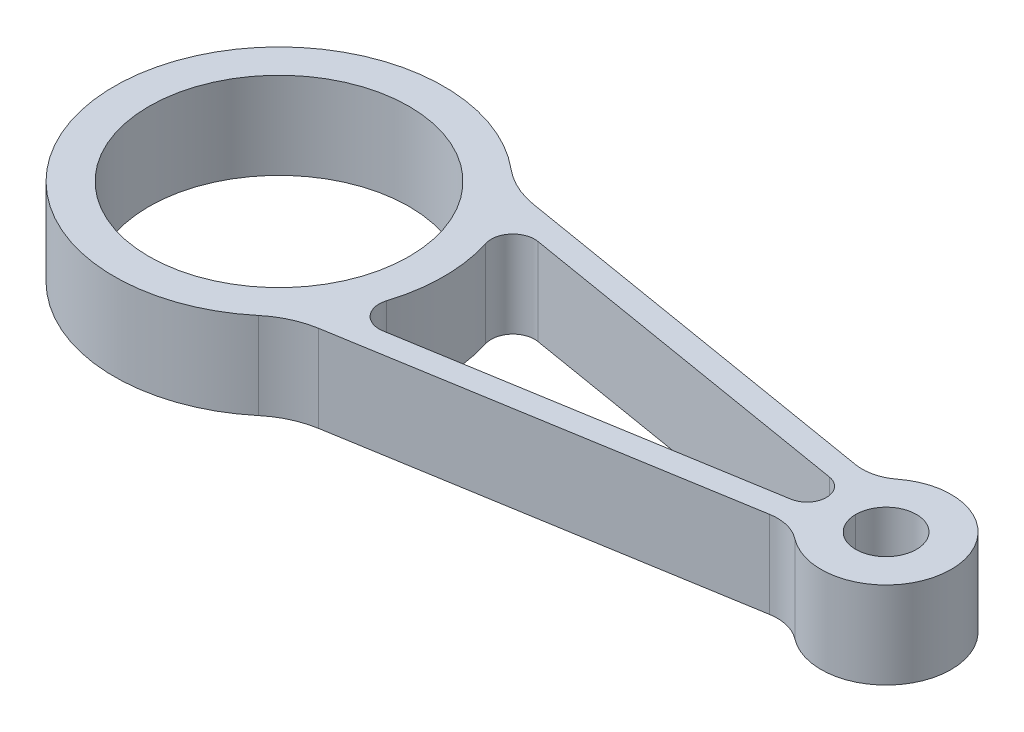
ISO-10303-21;
HEADER;
FILE_DESCRIPTION(('STEP AP214'),'2;1');
FILE_NAME('part.step','',(''),(''),'','','');
FILE_SCHEMA(('AUTOMOTIVE_DESIGN { 1 0 10303 214 1 1 1 1 }'));
ENDSEC;
DATA;
#1=APPLICATION_CONTEXT('core data for automotive mechanical design processes');
#2=APPLICATION_PROTOCOL_DEFINITION('international standard','automotive_design',2000,#1);
#3=PRODUCT_CONTEXT('',#1,'mechanical');
#4=PRODUCT('Part','Part','',(#3));
#5=PRODUCT_RELATED_PRODUCT_CATEGORY('part','',(#4));
#6=PRODUCT_DEFINITION_FORMATION('','',#4);
#7=PRODUCT_DEFINITION_CONTEXT('part definition',#1,'design');
#8=PRODUCT_DEFINITION('design','',#6,#7);
#9=PRODUCT_DEFINITION_SHAPE('','',#8);
#10=(LENGTH_UNIT() NAMED_UNIT(*) SI_UNIT(.MILLI.,.METRE.));
#11=(NAMED_UNIT(*) PLANE_ANGLE_UNIT() SI_UNIT($,.RADIAN.));
#12=(NAMED_UNIT(*) SI_UNIT($,.STERADIAN.) SOLID_ANGLE_UNIT());
#13=UNCERTAINTY_MEASURE_WITH_UNIT(LENGTH_MEASURE(1.E-05),#10,'distance_accuracy_value','');
#14=(GEOMETRIC_REPRESENTATION_CONTEXT(3) GLOBAL_UNCERTAINTY_ASSIGNED_CONTEXT((#13)) GLOBAL_UNIT_ASSIGNED_CONTEXT((#10,
#11,#12)) REPRESENTATION_CONTEXT('',''));
#15=CARTESIAN_POINT('',(0.,0.,0.));
#16=DIRECTION('',(0.,0.,1.));
#17=DIRECTION('',(1.,0.,0.));
#18=AXIS2_PLACEMENT_3D('',#15,#16,#17);
#19=CARTESIAN_POINT('',(140.,10.,0.));
#20=DIRECTION('',(0.,-1.,0.));
#21=DIRECTION('',(0.,0.,-1.));
#22=AXIS2_PLACEMENT_3D('',#19,#20,#21);
#23=CYLINDRICAL_SURFACE('',#22,7.00000000000001);
#24=CARTESIAN_POINT('',(140.,10.,0.));
#25=DIRECTION('',(0.,1.,0.));
#26=DIRECTION('',(0.,0.,1.));
#27=AXIS2_PLACEMENT_3D('',#24,#25,#26);
#28=CIRCLE('',#27,7.00000000000001);
#29=CARTESIAN_POINT('',(147.,10.,0.));
#30=VERTEX_POINT('',#29);
#31=CARTESIAN_POINT('',(133.,10.,0.));
#32=VERTEX_POINT('',#31);
#33=EDGE_CURVE('E210',#30,#32,#28,.T.);
#34=ORIENTED_EDGE('',*,*,#33,.T.);
#35=DIRECTION('',(0.,-1.,0.));
#36=VECTOR('',#35,1.);
#37=CARTESIAN_POINT('',(133.,10.,0.));
#38=LINE('',#37,#36);
#39=CARTESIAN_POINT('',(133.,-10.,0.));
#40=VERTEX_POINT('',#39);
#41=EDGE_CURVE('E11',#32,#40,#38,.T.);
#42=ORIENTED_EDGE('',*,*,#41,.T.);
#43=CARTESIAN_POINT('',(140.,-10.,0.));
#44=DIRECTION('',(0.,1.,0.));
#45=DIRECTION('',(0.,0.,1.));
#46=AXIS2_PLACEMENT_3D('',#43,#44,#45);
#47=CIRCLE('',#46,7.00000000000001);
#48=CARTESIAN_POINT('',(147.,-10.,0.));
#49=VERTEX_POINT('',#48);
#50=EDGE_CURVE('E214',#49,#40,#47,.T.);
#51=ORIENTED_EDGE('',*,*,#50,.F.);
#52=DIRECTION('',(0.,1.,0.));
#53=VECTOR('',#52,1.);
#54=CARTESIAN_POINT('',(147.,10.,0.));
#55=LINE('',#54,#53);
#56=EDGE_CURVE('E49',#49,#30,#55,.T.);
#57=ORIENTED_EDGE('',*,*,#56,.T.);
#58=EDGE_LOOP('',(#34,#42,#51,#57));
#59=FACE_BOUND('',#58,.T.);
#60=ADVANCED_FACE('F40',(#59),#23,.F.);
#61=CARTESIAN_POINT('',(0.,10.,0.));
#62=DIRECTION('',(0.,1.,0.));
#63=DIRECTION('',(0.,0.,1.));
#64=AXIS2_PLACEMENT_3D('',#61,#62,#63);
#65=PLANE('',#64);
#66=ORIENTED_EDGE('',*,*,#33,.F.);
#67=EDGE_CURVE('E213',#32,#30,#28,.T.);
#68=ORIENTED_EDGE('',*,*,#67,.F.);
#69=EDGE_LOOP('',(#66,#68));
#70=FACE_BOUND('',#69,.T.);
#71=CARTESIAN_POINT('',(140.,10.,0.));
#72=DIRECTION('',(0.,1.,0.));
#73=DIRECTION('',(0.,0.,1.));
#74=AXIS2_PLACEMENT_3D('',#71,#72,#73);
#75=CIRCLE('',#74,15.);
#76=CARTESIAN_POINT('',(130.826967155943,10.,11.8682546501942));
#77=VERTEX_POINT('',#76);
#78=CARTESIAN_POINT('',(130.826967155943,10.,-11.8682546501942));
#79=VERTEX_POINT('',#78);
#80=EDGE_CURVE('E230',#77,#79,#75,.T.);
#81=ORIENTED_EDGE('',*,*,#80,.T.);
#82=CARTESIAN_POINT('',(124.711611926572,10.,-19.7804244169904));
#83=DIRECTION('',(0.,1.,0.));
#84=DIRECTION('',(0.,0.,1.));
#85=AXIS2_PLACEMENT_3D('',#82,#83,#84);
#86=CIRCLE('',#85,10.);
#87=CARTESIAN_POINT('',(123.068754783715,10.,-9.91629645714704));
#88=VERTEX_POINT('',#87);
#89=EDGE_CURVE('E280',#79,#88,#86,.F.);
#90=ORIENTED_EDGE('',*,*,#89,.T.);
#91=DIRECTION('',(-0.986412795984335,0.,-0.164285714285714));
#92=VECTOR('',#91,1.);
#93=CARTESIAN_POINT('',(27.9354736759494,10.,-25.7606154914888));
#94=LINE('',#93,#92);
#95=CARTESIAN_POINT('',(33.9230677395358,10.,-24.7633898151861));
#96=VERTEX_POINT('',#95);
#97=EDGE_CURVE('E233',#88,#96,#94,.T.);
#98=ORIENTED_EDGE('',*,*,#97,.T.);
#99=CARTESIAN_POINT('',(37.2087820252501,10.,-44.4916457348728));
#100=DIRECTION('',(0.,1.,0.));
#101=DIRECTION('',(0.,0.,1.));
#102=AXIS2_PLACEMENT_3D('',#99,#100,#101);
#103=CIRCLE('',#102,20.);
#104=CARTESIAN_POINT('',(24.3781675337846,10.,-29.1496989297442));
#105=VERTEX_POINT('',#104);
#106=EDGE_CURVE('E258',#96,#105,#103,.F.);
#107=ORIENTED_EDGE('',*,*,#106,.T.);
#108=CARTESIAN_POINT('',(0.,10.,0.));
#109=DIRECTION('',(0.,1.,0.));
#110=DIRECTION('',(0.,0.,1.));
#111=AXIS2_PLACEMENT_3D('',#108,#109,#110);
#112=CIRCLE('',#111,38.);
#113=CARTESIAN_POINT('',(24.3781675337846,10.,29.1496989297442));
#114=VERTEX_POINT('',#113);
#115=EDGE_CURVE('E223',#105,#114,#112,.T.);
#116=ORIENTED_EDGE('',*,*,#115,.T.);
#117=CARTESIAN_POINT('',(37.2087820252501,10.,44.4916457348728));
#118=DIRECTION('',(0.,1.,0.));
#119=DIRECTION('',(0.,0.,1.));
#120=AXIS2_PLACEMENT_3D('',#117,#118,#119);
#121=CIRCLE('',#120,20.);
#122=CARTESIAN_POINT('',(33.9230677395359,10.,24.7633898151861));
#123=VERTEX_POINT('',#122);
#124=EDGE_CURVE('E262',#114,#123,#121,.F.);
#125=ORIENTED_EDGE('',*,*,#124,.T.);
#126=DIRECTION('',(0.986412795984335,0.,-0.164285714285714));
#127=VECTOR('',#126,1.);
#128=CARTESIAN_POINT('',(27.9354736759495,10.,25.7606154914888));
#129=LINE('',#128,#127);
#130=CARTESIAN_POINT('',(123.068754783715,10.,9.91629645714702));
#131=VERTEX_POINT('',#130);
#132=EDGE_CURVE('E226',#123,#131,#129,.T.);
#133=ORIENTED_EDGE('',*,*,#132,.T.);
#134=CARTESIAN_POINT('',(124.711611926572,10.,19.7804244169904));
#135=DIRECTION('',(0.,1.,0.));
#136=DIRECTION('',(0.,0.,1.));
#137=AXIS2_PLACEMENT_3D('',#134,#135,#136);
#138=CIRCLE('',#137,10.);
#139=EDGE_CURVE('E276',#131,#77,#138,.F.);
#140=ORIENTED_EDGE('',*,*,#139,.T.);
#141=EDGE_LOOP('',(#81,#90,#98,#107,#116,#125,#133,#140));
#142=FACE_BOUND('',#141,.T.);
#143=CARTESIAN_POINT('',(0.,10.,0.));
#144=DIRECTION('',(0.,1.,0.));
#145=DIRECTION('',(0.,0.,1.));
#146=AXIS2_PLACEMENT_3D('',#143,#144,#145);
#147=CIRCLE('',#146,30.);
#148=CARTESIAN_POINT('',(0.,10.,30.));
#149=VERTEX_POINT('',#148);
#150=EDGE_CURVE('E217',#149,#149,#147,.T.);
#151=ORIENTED_EDGE('',*,*,#150,.F.);
#152=EDGE_LOOP('',(#151));
#153=FACE_BOUND('',#152,.T.);
#154=CARTESIAN_POINT('',(41.0071259869049,10.,-12.9389187451698));
#155=DIRECTION('',(0.,1.,0.));
#156=DIRECTION('',(0.,0.,-1.));
#157=AXIS2_PLACEMENT_3D('',#154,#155,#156);
#158=CIRCLE('',#157,5.);
#159=CARTESIAN_POINT('',(41.8285545583335,10.,-17.8709827250915));
#160=VERTEX_POINT('',#159);
#161=CARTESIAN_POINT('',(36.2388555233113,10.,-11.4343933096849));
#162=VERTEX_POINT('',#161);
#163=EDGE_CURVE('E158',#160,#162,#158,.T.);
#164=ORIENTED_EDGE('',*,*,#163,.F.);
#165=DIRECTION('',(-0.986412795984335,0.,-0.164285714285714));
#166=VECTOR('',#165,1.);
#167=CARTESIAN_POINT('',(41.8285545583335,10.,-17.8709827250915));
#168=LINE('',#167,#166);
#169=CARTESIAN_POINT('',(122.478416149068,10.,-4.43885758192951));
#170=VERTEX_POINT('',#169);
#171=EDGE_CURVE('E176',#170,#160,#168,.T.);
#172=ORIENTED_EDGE('',*,*,#171,.F.);
#173=CARTESIAN_POINT('',(121.739130434783,10.,0.));
#174=DIRECTION('',(0.,1.,0.));
#175=DIRECTION('',(0.,0.,-1.));
#176=AXIS2_PLACEMENT_3D('',#173,#174,#175);
#177=CIRCLE('',#176,4.50000000000001);
#178=CARTESIAN_POINT('',(122.478416149068,10.,4.43885758192951));
#179=VERTEX_POINT('',#178);
#180=EDGE_CURVE('E179',#179,#170,#177,.T.);
#181=ORIENTED_EDGE('',*,*,#180,.F.);
#182=DIRECTION('',(0.986412795984335,0.,-0.164285714285714));
#183=VECTOR('',#182,1.);
#184=CARTESIAN_POINT('',(41.8285545583335,10.,17.8709827250915));
#185=LINE('',#184,#183);
#186=CARTESIAN_POINT('',(41.8285545583335,10.,17.8709827250915));
#187=VERTEX_POINT('',#186);
#188=EDGE_CURVE('E195',#187,#179,#185,.T.);
#189=ORIENTED_EDGE('',*,*,#188,.F.);
#190=CARTESIAN_POINT('',(41.0071259869049,10.,12.9389187451698));
#191=DIRECTION('',(0.,1.,0.));
#192=DIRECTION('',(0.,0.,1.));
#193=AXIS2_PLACEMENT_3D('',#190,#191,#192);
#194=CIRCLE('',#193,5.);
#195=CARTESIAN_POINT('',(36.2388555233113,10.,11.4343933096849));
#196=VERTEX_POINT('',#195);
#197=EDGE_CURVE('E192',#196,#187,#194,.T.);
#198=ORIENTED_EDGE('',*,*,#197,.F.);
#199=CARTESIAN_POINT('',(0.,10.,0.));
#200=DIRECTION('',(0.,-1.,0.));
#201=DIRECTION('',(0.,0.,-1.));
#202=AXIS2_PLACEMENT_3D('',#199,#200,#201);
#203=CIRCLE('',#202,38.);
#204=EDGE_CURVE('E190',#162,#196,#203,.T.);
#205=ORIENTED_EDGE('',*,*,#204,.F.);
#206=EDGE_LOOP('',(#164,#172,#181,#189,#198,#205));
#207=FACE_BOUND('',#206,.T.);
#208=ADVANCED_FACE('F288',(#70,#142,#153,#207),#65,.T.);
#209=CARTESIAN_POINT('',(0.,-10.,0.));
#210=DIRECTION('',(0.,1.,0.));
#211=DIRECTION('',(0.,0.,1.));
#212=AXIS2_PLACEMENT_3D('',#209,#210,#211);
#213=PLANE('',#212);
#214=CARTESIAN_POINT('',(0.,-10.,0.));
#215=DIRECTION('',(0.,1.,0.));
#216=DIRECTION('',(0.,0.,1.));
#217=AXIS2_PLACEMENT_3D('',#214,#215,#216);
#218=CIRCLE('',#217,38.);
#219=CARTESIAN_POINT('',(24.3781675337846,-10.,-29.1496989297442));
#220=VERTEX_POINT('',#219);
#221=CARTESIAN_POINT('',(24.3781675337846,-10.,29.1496989297442));
#222=VERTEX_POINT('',#221);
#223=EDGE_CURVE('E220',#220,#222,#218,.T.);
#224=ORIENTED_EDGE('',*,*,#223,.F.);
#225=CARTESIAN_POINT('',(37.2087820252501,-10.,-44.4916457348728));
#226=DIRECTION('',(0.,1.,0.));
#227=DIRECTION('',(0.,0.,1.));
#228=AXIS2_PLACEMENT_3D('',#225,#226,#227);
#229=CIRCLE('',#228,20.);
#230=CARTESIAN_POINT('',(33.9230677395358,-10.,-24.7633898151861));
#231=VERTEX_POINT('',#230);
#232=EDGE_CURVE('E255',#220,#231,#229,.T.);
#233=ORIENTED_EDGE('',*,*,#232,.T.);
#234=DIRECTION('',(-0.986412795984335,0.,-0.164285714285714));
#235=VECTOR('',#234,1.);
#236=CARTESIAN_POINT('',(27.9354736759494,-10.,-25.7606154914888));
#237=LINE('',#236,#235);
#238=CARTESIAN_POINT('',(123.068754783715,-10.,-9.91629645714704));
#239=VERTEX_POINT('',#238);
#240=EDGE_CURVE('E227',#239,#231,#237,.T.);
#241=ORIENTED_EDGE('',*,*,#240,.F.);
#242=CARTESIAN_POINT('',(124.711611926572,-10.,-19.7804244169904));
#243=DIRECTION('',(0.,1.,0.));
#244=DIRECTION('',(0.,0.,1.));
#245=AXIS2_PLACEMENT_3D('',#242,#243,#244);
#246=CIRCLE('',#245,10.);
#247=CARTESIAN_POINT('',(130.826967155943,-10.,-11.8682546501942));
#248=VERTEX_POINT('',#247);
#249=EDGE_CURVE('E278',#239,#248,#246,.T.);
#250=ORIENTED_EDGE('',*,*,#249,.T.);
#251=CARTESIAN_POINT('',(140.,-10.,0.));
#252=DIRECTION('',(0.,1.,0.));
#253=DIRECTION('',(0.,0.,1.));
#254=AXIS2_PLACEMENT_3D('',#251,#252,#253);
#255=CIRCLE('',#254,15.);
#256=CARTESIAN_POINT('',(130.826967155943,-10.,11.8682546501942));
#257=VERTEX_POINT('',#256);
#258=EDGE_CURVE('E241',#257,#248,#255,.T.);
#259=ORIENTED_EDGE('',*,*,#258,.F.);
#260=CARTESIAN_POINT('',(124.711611926572,-10.,19.7804244169904));
#261=DIRECTION('',(0.,1.,0.));
#262=DIRECTION('',(0.,0.,1.));
#263=AXIS2_PLACEMENT_3D('',#260,#261,#262);
#264=CIRCLE('',#263,10.);
#265=CARTESIAN_POINT('',(123.068754783715,-10.,9.91629645714702));
#266=VERTEX_POINT('',#265);
#267=EDGE_CURVE('E274',#257,#266,#264,.T.);
#268=ORIENTED_EDGE('',*,*,#267,.T.);
#269=DIRECTION('',(0.986412795984335,0.,-0.164285714285714));
#270=VECTOR('',#269,1.);
#271=CARTESIAN_POINT('',(27.9354736759495,-10.,25.7606154914888));
#272=LINE('',#271,#270);
#273=CARTESIAN_POINT('',(33.9230677395359,-10.,24.7633898151861));
#274=VERTEX_POINT('',#273);
#275=EDGE_CURVE('E238',#274,#266,#272,.T.);
#276=ORIENTED_EDGE('',*,*,#275,.F.);
#277=CARTESIAN_POINT('',(37.2087820252501,-10.,44.4916457348728));
#278=DIRECTION('',(0.,1.,0.));
#279=DIRECTION('',(0.,0.,1.));
#280=AXIS2_PLACEMENT_3D('',#277,#278,#279);
#281=CIRCLE('',#280,20.);
#282=EDGE_CURVE('E260',#274,#222,#281,.T.);
#283=ORIENTED_EDGE('',*,*,#282,.T.);
#284=EDGE_LOOP('',(#224,#233,#241,#250,#259,#268,#276,#283));
#285=FACE_BOUND('',#284,.T.);
#286=CARTESIAN_POINT('',(0.,-10.,0.));
#287=DIRECTION('',(0.,1.,0.));
#288=DIRECTION('',(0.,0.,1.));
#289=AXIS2_PLACEMENT_3D('',#286,#287,#288);
#290=CIRCLE('',#289,30.);
#291=CARTESIAN_POINT('',(0.,-10.,30.));
#292=VERTEX_POINT('',#291);
#293=EDGE_CURVE('E212',#292,#292,#290,.T.);
#294=ORIENTED_EDGE('',*,*,#293,.T.);
#295=EDGE_LOOP('',(#294));
#296=FACE_BOUND('',#295,.T.);
#297=ORIENTED_EDGE('',*,*,#50,.T.);
#298=EDGE_CURVE('E202',#40,#49,#47,.T.);
#299=ORIENTED_EDGE('',*,*,#298,.T.);
#300=EDGE_LOOP('',(#297,#299));
#301=FACE_BOUND('',#300,.T.);
#302=DIRECTION('',(-0.986412795984335,0.,-0.164285714285714));
#303=VECTOR('',#302,1.);
#304=CARTESIAN_POINT('',(41.8285545583335,-10.,-17.8709827250915));
#305=LINE('',#304,#303);
#306=CARTESIAN_POINT('',(122.478416149068,-10.,-4.43885758192951));
#307=VERTEX_POINT('',#306);
#308=CARTESIAN_POINT('',(41.8285545583335,-10.,-17.8709827250915));
#309=VERTEX_POINT('',#308);
#310=EDGE_CURVE('E163',#307,#309,#305,.T.);
#311=ORIENTED_EDGE('',*,*,#310,.T.);
#312=CARTESIAN_POINT('',(41.0071259869049,-10.,-12.9389187451698));
#313=DIRECTION('',(0.,1.,0.));
#314=DIRECTION('',(0.,0.,-1.));
#315=AXIS2_PLACEMENT_3D('',#312,#313,#314);
#316=CIRCLE('',#315,5.);
#317=CARTESIAN_POINT('',(36.2388555233113,-10.,-11.4343933096849));
#318=VERTEX_POINT('',#317);
#319=EDGE_CURVE('E155',#309,#318,#316,.T.);
#320=ORIENTED_EDGE('',*,*,#319,.T.);
#321=CARTESIAN_POINT('',(0.,-10.,0.));
#322=DIRECTION('',(0.,-1.,0.));
#323=DIRECTION('',(0.,0.,-1.));
#324=AXIS2_PLACEMENT_3D('',#321,#322,#323);
#325=CIRCLE('',#324,38.);
#326=CARTESIAN_POINT('',(36.2388555233113,-10.,11.4343933096849));
#327=VERTEX_POINT('',#326);
#328=EDGE_CURVE('E167',#318,#327,#325,.T.);
#329=ORIENTED_EDGE('',*,*,#328,.T.);
#330=CARTESIAN_POINT('',(41.0071259869049,-10.,12.9389187451698));
#331=DIRECTION('',(0.,1.,0.));
#332=DIRECTION('',(0.,0.,1.));
#333=AXIS2_PLACEMENT_3D('',#330,#331,#332);
#334=CIRCLE('',#333,5.);
#335=CARTESIAN_POINT('',(41.8285545583335,-10.,17.8709827250915));
#336=VERTEX_POINT('',#335);
#337=EDGE_CURVE('E171',#327,#336,#334,.T.);
#338=ORIENTED_EDGE('',*,*,#337,.T.);
#339=DIRECTION('',(0.986412795984335,0.,-0.164285714285714));
#340=VECTOR('',#339,1.);
#341=CARTESIAN_POINT('',(41.8285545583335,-10.,17.8709827250915));
#342=LINE('',#341,#340);
#343=CARTESIAN_POINT('',(122.478416149068,-10.,4.43885758192951));
#344=VERTEX_POINT('',#343);
#345=EDGE_CURVE('E183',#336,#344,#342,.T.);
#346=ORIENTED_EDGE('',*,*,#345,.T.);
#347=CARTESIAN_POINT('',(121.739130434783,-10.,0.));
#348=DIRECTION('',(0.,1.,0.));
#349=DIRECTION('',(0.,0.,-1.));
#350=AXIS2_PLACEMENT_3D('',#347,#348,#349);
#351=CIRCLE('',#350,4.50000000000001);
#352=EDGE_CURVE('E186',#344,#307,#351,.T.);
#353=ORIENTED_EDGE('',*,*,#352,.T.);
#354=EDGE_LOOP('',(#311,#320,#329,#338,#346,#353));
#355=FACE_BOUND('',#354,.T.);
#356=ADVANCED_FACE('F173',(#285,#296,#301,#355),#213,.F.);
#357=CARTESIAN_POINT('',(0.,10.,0.));
#358=DIRECTION('',(0.,-1.,0.));
#359=DIRECTION('',(0.,0.,-1.));
#360=AXIS2_PLACEMENT_3D('',#357,#358,#359);
#361=CYLINDRICAL_SURFACE('',#360,38.);
#362=ORIENTED_EDGE('',*,*,#115,.F.);
#363=DIRECTION('',(0.,-1.,0.));
#364=VECTOR('',#363,1.);
#365=CARTESIAN_POINT('',(24.3781675337846,10.,-29.1496989297442));
#366=LINE('',#365,#364);
#367=EDGE_CURVE('E246',#105,#220,#366,.T.);
#368=ORIENTED_EDGE('',*,*,#367,.T.);
#369=ORIENTED_EDGE('',*,*,#223,.T.);
#370=DIRECTION('',(0.,-1.,0.));
#371=VECTOR('',#370,1.);
#372=CARTESIAN_POINT('',(24.3781675337846,10.,29.1496989297442));
#373=LINE('',#372,#371);
#374=EDGE_CURVE('E235',#222,#114,#373,.F.);
#375=ORIENTED_EDGE('',*,*,#374,.T.);
#376=EDGE_LOOP('',(#362,#368,#369,#375));
#377=FACE_BOUND('',#376,.T.);
#378=ADVANCED_FACE('F314',(#377),#361,.T.);
#379=CARTESIAN_POINT('',(27.9354736759495,10.,25.7606154914888));
#380=DIRECTION('',(-0.164285714285714,0.,-0.986412795984335));
#381=DIRECTION('',(-0.986412795984335,0.,0.164285714285714));
#382=AXIS2_PLACEMENT_3D('',#379,#380,#381);
#383=PLANE('',#382);
#384=ORIENTED_EDGE('',*,*,#275,.T.);
#385=DIRECTION('',(0.,1.,0.));
#386=VECTOR('',#385,1.);
#387=CARTESIAN_POINT('',(123.068754783715,10.,9.91629645714702));
#388=LINE('',#387,#386);
#389=EDGE_CURVE('E269',#266,#131,#388,.T.);
#390=ORIENTED_EDGE('',*,*,#389,.T.);
#391=ORIENTED_EDGE('',*,*,#132,.F.);
#392=DIRECTION('',(0.,1.,0.));
#393=VECTOR('',#392,1.);
#394=CARTESIAN_POINT('',(33.9230677395359,-10.,24.7633898151861));
#395=LINE('',#394,#393);
#396=EDGE_CURVE('E252',#123,#274,#395,.F.);
#397=ORIENTED_EDGE('',*,*,#396,.T.);
#398=EDGE_LOOP('',(#384,#390,#391,#397));
#399=FACE_BOUND('',#398,.T.);
#400=ADVANCED_FACE('F324',(#399),#383,.F.);
#401=CARTESIAN_POINT('',(140.,10.,0.));
#402=DIRECTION('',(0.,-1.,0.));
#403=DIRECTION('',(0.,0.,-1.));
#404=AXIS2_PLACEMENT_3D('',#401,#402,#403);
#405=CYLINDRICAL_SURFACE('',#404,15.);
#406=ORIENTED_EDGE('',*,*,#80,.F.);
#407=DIRECTION('',(0.,-1.,0.));
#408=VECTOR('',#407,1.);
#409=CARTESIAN_POINT('',(130.826967155943,10.,11.8682546501942));
#410=LINE('',#409,#408);
#411=EDGE_CURVE('E266',#77,#257,#410,.T.);
#412=ORIENTED_EDGE('',*,*,#411,.T.);
#413=ORIENTED_EDGE('',*,*,#258,.T.);
#414=DIRECTION('',(0.,-1.,0.));
#415=VECTOR('',#414,1.);
#416=CARTESIAN_POINT('',(130.826967155943,10.,-11.8682546501942));
#417=LINE('',#416,#415);
#418=EDGE_CURVE('E264',#248,#79,#417,.F.);
#419=ORIENTED_EDGE('',*,*,#418,.T.);
#420=EDGE_LOOP('',(#406,#412,#413,#419));
#421=FACE_BOUND('',#420,.T.);
#422=ADVANCED_FACE('F320',(#421),#405,.T.);
#423=CARTESIAN_POINT('',(27.9354736759494,10.,-25.7606154914888));
#424=DIRECTION('',(-0.164285714285714,0.,0.986412795984335));
#425=DIRECTION('',(0.986412795984335,0.,0.164285714285714));
#426=AXIS2_PLACEMENT_3D('',#423,#424,#425);
#427=PLANE('',#426);
#428=ORIENTED_EDGE('',*,*,#97,.F.);
#429=DIRECTION('',(0.,1.,0.));
#430=VECTOR('',#429,1.);
#431=CARTESIAN_POINT('',(123.068754783715,-10.,-9.91629645714704));
#432=LINE('',#431,#430);
#433=EDGE_CURVE('E271',#88,#239,#432,.F.);
#434=ORIENTED_EDGE('',*,*,#433,.T.);
#435=ORIENTED_EDGE('',*,*,#240,.T.);
#436=DIRECTION('',(0.,1.,0.));
#437=VECTOR('',#436,1.);
#438=CARTESIAN_POINT('',(33.9230677395358,10.,-24.7633898151861));
#439=LINE('',#438,#437);
#440=EDGE_CURVE('E249',#231,#96,#439,.T.);
#441=ORIENTED_EDGE('',*,*,#440,.T.);
#442=EDGE_LOOP('',(#428,#434,#435,#441));
#443=FACE_BOUND('',#442,.T.);
#444=ADVANCED_FACE('F302',(#443),#427,.F.);
#445=CARTESIAN_POINT('',(0.,10.,0.));
#446=DIRECTION('',(0.,-1.,0.));
#447=DIRECTION('',(0.,0.,-1.));
#448=AXIS2_PLACEMENT_3D('',#445,#446,#447);
#449=CYLINDRICAL_SURFACE('',#448,30.);
#450=ORIENTED_EDGE('',*,*,#150,.T.);
#451=EDGE_LOOP('',(#450));
#452=FACE_BOUND('',#451,.T.);
#453=ORIENTED_EDGE('',*,*,#293,.F.);
#454=EDGE_LOOP('',(#453));
#455=FACE_BOUND('',#454,.T.);
#456=ADVANCED_FACE('F293',(#452,#455),#449,.F.);
#457=ORIENTED_EDGE('',*,*,#41,.F.);
#458=ORIENTED_EDGE('',*,*,#67,.T.);
#459=ORIENTED_EDGE('',*,*,#56,.F.);
#460=ORIENTED_EDGE('',*,*,#298,.F.);
#461=EDGE_LOOP('',(#457,#458,#459,#460));
#462=FACE_BOUND('',#461,.T.);
#463=ADVANCED_FACE('F290',(#462),#23,.F.);
#464=CARTESIAN_POINT('',(37.2087820252501,10.,-44.4916457348728));
#465=DIRECTION('',(0.,-1.,0.));
#466=DIRECTION('',(0.,0.,-1.));
#467=AXIS2_PLACEMENT_3D('',#464,#465,#466);
#468=CYLINDRICAL_SURFACE('',#467,20.);
#469=ORIENTED_EDGE('',*,*,#106,.F.);
#470=ORIENTED_EDGE('',*,*,#440,.F.);
#471=ORIENTED_EDGE('',*,*,#232,.F.);
#472=ORIENTED_EDGE('',*,*,#367,.F.);
#473=EDGE_LOOP('',(#469,#470,#471,#472));
#474=FACE_BOUND('',#473,.T.);
#475=ADVANCED_FACE('F292',(#474),#468,.F.);
#476=CARTESIAN_POINT('',(37.2087820252501,10.,44.4916457348728));
#477=DIRECTION('',(0.,-1.,0.));
#478=DIRECTION('',(0.,0.,-1.));
#479=AXIS2_PLACEMENT_3D('',#476,#477,#478);
#480=CYLINDRICAL_SURFACE('',#479,20.);
#481=ORIENTED_EDGE('',*,*,#124,.F.);
#482=ORIENTED_EDGE('',*,*,#374,.F.);
#483=ORIENTED_EDGE('',*,*,#282,.F.);
#484=ORIENTED_EDGE('',*,*,#396,.F.);
#485=EDGE_LOOP('',(#481,#482,#483,#484));
#486=FACE_BOUND('',#485,.T.);
#487=ADVANCED_FACE('F299',(#486),#480,.F.);
#488=CARTESIAN_POINT('',(124.711611926572,10.,19.7804244169904));
#489=DIRECTION('',(0.,-1.,0.));
#490=DIRECTION('',(0.,0.,-1.));
#491=AXIS2_PLACEMENT_3D('',#488,#489,#490);
#492=CYLINDRICAL_SURFACE('',#491,10.);
#493=ORIENTED_EDGE('',*,*,#139,.F.);
#494=ORIENTED_EDGE('',*,*,#389,.F.);
#495=ORIENTED_EDGE('',*,*,#267,.F.);
#496=ORIENTED_EDGE('',*,*,#411,.F.);
#497=EDGE_LOOP('',(#493,#494,#495,#496));
#498=FACE_BOUND('',#497,.T.);
#499=ADVANCED_FACE('F333',(#498),#492,.F.);
#500=CARTESIAN_POINT('',(124.711611926572,10.,-19.7804244169904));
#501=DIRECTION('',(0.,-1.,0.));
#502=DIRECTION('',(0.,0.,-1.));
#503=AXIS2_PLACEMENT_3D('',#500,#501,#502);
#504=CYLINDRICAL_SURFACE('',#503,10.);
#505=ORIENTED_EDGE('',*,*,#89,.F.);
#506=ORIENTED_EDGE('',*,*,#418,.F.);
#507=ORIENTED_EDGE('',*,*,#249,.F.);
#508=ORIENTED_EDGE('',*,*,#433,.F.);
#509=EDGE_LOOP('',(#505,#506,#507,#508));
#510=FACE_BOUND('',#509,.T.);
#511=ADVANCED_FACE('F42',(#510),#504,.F.);
#512=CARTESIAN_POINT('',(41.0071259869049,-10.,-12.9389187451698));
#513=DIRECTION('',(0.,1.,0.));
#514=DIRECTION('',(0.,0.,1.));
#515=AXIS2_PLACEMENT_3D('',#512,#513,#514);
#516=CYLINDRICAL_SURFACE('',#515,5.);
#517=ORIENTED_EDGE('',*,*,#163,.T.);
#518=DIRECTION('',(0.,1.,0.));
#519=VECTOR('',#518,1.);
#520=CARTESIAN_POINT('',(36.2388555233113,-10.,-11.4343933096849));
#521=LINE('',#520,#519);
#522=EDGE_CURVE('E151',#318,#162,#521,.T.);
#523=ORIENTED_EDGE('',*,*,#522,.F.);
#524=ORIENTED_EDGE('',*,*,#319,.F.);
#525=DIRECTION('',(0.,1.,0.));
#526=VECTOR('',#525,1.);
#527=CARTESIAN_POINT('',(41.8285545583335,-10.,-17.8709827250915));
#528=LINE('',#527,#526);
#529=EDGE_CURVE('E200',#309,#160,#528,.T.);
#530=ORIENTED_EDGE('',*,*,#529,.T.);
#531=EDGE_LOOP('',(#517,#523,#524,#530));
#532=FACE_BOUND('',#531,.T.);
#533=ADVANCED_FACE('F153',(#532),#516,.F.);
#534=CARTESIAN_POINT('',(41.8285545583335,-10.,-17.8709827250915));
#535=DIRECTION('',(0.164285714285714,0.,-0.986412795984335));
#536=DIRECTION('',(-0.986412795984335,0.,-0.164285714285714));
#537=AXIS2_PLACEMENT_3D('',#534,#535,#536);
#538=PLANE('',#537);
#539=ORIENTED_EDGE('',*,*,#171,.T.);
#540=ORIENTED_EDGE('',*,*,#529,.F.);
#541=ORIENTED_EDGE('',*,*,#310,.F.);
#542=DIRECTION('',(0.,1.,0.));
#543=VECTOR('',#542,1.);
#544=CARTESIAN_POINT('',(122.478416149068,-10.,-4.43885758192951));
#545=LINE('',#544,#543);
#546=EDGE_CURVE('E203',#307,#170,#545,.T.);
#547=ORIENTED_EDGE('',*,*,#546,.T.);
#548=EDGE_LOOP('',(#539,#540,#541,#547));
#549=FACE_BOUND('',#548,.T.);
#550=ADVANCED_FACE('F381',(#549),#538,.F.);
#551=CARTESIAN_POINT('',(121.739130434783,-10.,0.));
#552=DIRECTION('',(0.,1.,0.));
#553=DIRECTION('',(0.,0.,1.));
#554=AXIS2_PLACEMENT_3D('',#551,#552,#553);
#555=CYLINDRICAL_SURFACE('',#554,4.50000000000001);
#556=ORIENTED_EDGE('',*,*,#180,.T.);
#557=ORIENTED_EDGE('',*,*,#546,.F.);
#558=ORIENTED_EDGE('',*,*,#352,.F.);
#559=DIRECTION('',(0.,1.,0.));
#560=VECTOR('',#559,1.);
#561=CARTESIAN_POINT('',(122.478416149068,-10.,4.43885758192951));
#562=LINE('',#561,#560);
#563=EDGE_CURVE('E205',#344,#179,#562,.T.);
#564=ORIENTED_EDGE('',*,*,#563,.T.);
#565=EDGE_LOOP('',(#556,#557,#558,#564));
#566=FACE_BOUND('',#565,.T.);
#567=ADVANCED_FACE('F379',(#566),#555,.F.);
#568=CARTESIAN_POINT('',(41.8285545583335,-10.,17.8709827250915));
#569=DIRECTION('',(0.164285714285714,0.,0.986412795984335));
#570=DIRECTION('',(0.986412795984335,0.,-0.164285714285714));
#571=AXIS2_PLACEMENT_3D('',#568,#569,#570);
#572=PLANE('',#571);
#573=ORIENTED_EDGE('',*,*,#188,.T.);
#574=ORIENTED_EDGE('',*,*,#563,.F.);
#575=ORIENTED_EDGE('',*,*,#345,.F.);
#576=DIRECTION('',(0.,1.,0.));
#577=VECTOR('',#576,1.);
#578=CARTESIAN_POINT('',(41.8285545583335,-10.,17.8709827250915));
#579=LINE('',#578,#577);
#580=EDGE_CURVE('E207',#336,#187,#579,.T.);
#581=ORIENTED_EDGE('',*,*,#580,.T.);
#582=EDGE_LOOP('',(#573,#574,#575,#581));
#583=FACE_BOUND('',#582,.T.);
#584=ADVANCED_FACE('F377',(#583),#572,.F.);
#585=CARTESIAN_POINT('',(41.0071259869049,-10.,12.9389187451698));
#586=DIRECTION('',(0.,1.,0.));
#587=DIRECTION('',(0.,0.,1.));
#588=AXIS2_PLACEMENT_3D('',#585,#586,#587);
#589=CYLINDRICAL_SURFACE('',#588,5.);
#590=ORIENTED_EDGE('',*,*,#197,.T.);
#591=ORIENTED_EDGE('',*,*,#580,.F.);
#592=ORIENTED_EDGE('',*,*,#337,.F.);
#593=DIRECTION('',(0.,1.,0.));
#594=VECTOR('',#593,1.);
#595=CARTESIAN_POINT('',(36.2388555233113,-10.,11.4343933096849));
#596=LINE('',#595,#594);
#597=EDGE_CURVE('E162',#327,#196,#596,.T.);
#598=ORIENTED_EDGE('',*,*,#597,.T.);
#599=EDGE_LOOP('',(#590,#591,#592,#598));
#600=FACE_BOUND('',#599,.T.);
#601=ADVANCED_FACE('F373',(#600),#589,.F.);
#602=CARTESIAN_POINT('',(0.,-10.,0.));
#603=DIRECTION('',(0.,1.,0.));
#604=DIRECTION('',(0.,0.,1.));
#605=AXIS2_PLACEMENT_3D('',#602,#603,#604);
#606=CYLINDRICAL_SURFACE('',#605,38.);
#607=ORIENTED_EDGE('',*,*,#204,.T.);
#608=ORIENTED_EDGE('',*,*,#597,.F.);
#609=ORIENTED_EDGE('',*,*,#328,.F.);
#610=ORIENTED_EDGE('',*,*,#522,.T.);
#611=EDGE_LOOP('',(#607,#608,#609,#610));
#612=FACE_BOUND('',#611,.T.);
#613=ADVANCED_FACE('F168',(#612),#606,.T.);
#614=CLOSED_SHELL('',(#60,#208,#356,#378,#400,#422,#444,#456,#463,#475,#487,#499,#511,#533,#550,
#567,#584,#601,#613));
#615=MANIFOLD_SOLID_BREP('B2',#614);
#616=ADVANCED_BREP_SHAPE_REPRESENTATION('',(#18,#615),#14);
#617=SHAPE_DEFINITION_REPRESENTATION(#9,#616);
ENDSEC;
END-ISO-10303-21;
